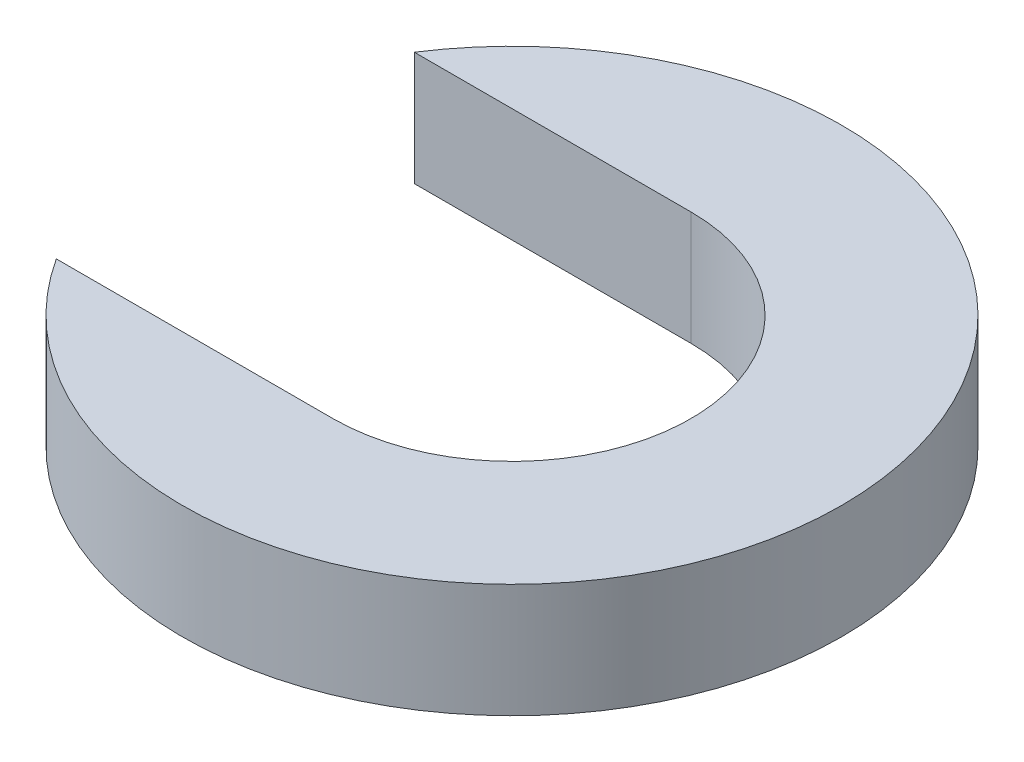
ISO-10303-21;
HEADER;
FILE_DESCRIPTION(('STEP AP214'),'2;1');
FILE_NAME('part.step','',(''),(''),'','','');
FILE_SCHEMA(('AUTOMOTIVE_DESIGN { 1 0 10303 214 1 1 1 1 }'));
ENDSEC;
DATA;
#1=APPLICATION_CONTEXT('core data for automotive mechanical design processes');
#2=APPLICATION_PROTOCOL_DEFINITION('international standard','automotive_design',2000,#1);
#3=PRODUCT_CONTEXT('',#1,'mechanical');
#4=PRODUCT('Part','Part','',(#3));
#5=PRODUCT_RELATED_PRODUCT_CATEGORY('part','',(#4));
#6=PRODUCT_DEFINITION_FORMATION('','',#4);
#7=PRODUCT_DEFINITION_CONTEXT('part definition',#1,'design');
#8=PRODUCT_DEFINITION('design','',#6,#7);
#9=PRODUCT_DEFINITION_SHAPE('','',#8);
#10=(LENGTH_UNIT() NAMED_UNIT(*) SI_UNIT(.MILLI.,.METRE.));
#11=(NAMED_UNIT(*) PLANE_ANGLE_UNIT() SI_UNIT($,.RADIAN.));
#12=(NAMED_UNIT(*) SI_UNIT($,.STERADIAN.) SOLID_ANGLE_UNIT());
#13=UNCERTAINTY_MEASURE_WITH_UNIT(LENGTH_MEASURE(1.E-05),#10,'distance_accuracy_value','');
#14=(GEOMETRIC_REPRESENTATION_CONTEXT(3) GLOBAL_UNCERTAINTY_ASSIGNED_CONTEXT((#13)) GLOBAL_UNIT_ASSIGNED_CONTEXT((#10,
#11,#12)) REPRESENTATION_CONTEXT('',''));
#15=CARTESIAN_POINT('',(0.,0.,0.));
#16=DIRECTION('',(0.,0.,1.));
#17=DIRECTION('',(1.,0.,0.));
#18=AXIS2_PLACEMENT_3D('',#15,#16,#17);
#19=CARTESIAN_POINT('',(0.,3.1496,0.));
#20=DIRECTION('',(0.,-1.,0.));
#21=DIRECTION('',(0.,0.,-1.));
#22=AXIS2_PLACEMENT_3D('',#19,#20,#21);
#23=CYLINDRICAL_SURFACE('',#22,4.953);
#24=CARTESIAN_POINT('',(0.,0.,0.));
#25=DIRECTION('',(0.,-1.,0.));
#26=DIRECTION('',(0.,0.,1.));
#27=AXIS2_PLACEMENT_3D('',#24,#25,#26);
#28=CIRCLE('',#27,4.953);
#29=CARTESIAN_POINT('',(0.,0.,-4.953));
#30=VERTEX_POINT('',#29);
#31=CARTESIAN_POINT('',(0.,0.,4.953));
#32=VERTEX_POINT('',#31);
#33=EDGE_CURVE('E102',#30,#32,#28,.T.);
#34=ORIENTED_EDGE('',*,*,#33,.T.);
#35=DIRECTION('',(0.,-1.,0.));
#36=VECTOR('',#35,1.);
#37=CARTESIAN_POINT('',(0.,3.1496,4.953));
#38=LINE('',#37,#36);
#39=CARTESIAN_POINT('',(0.,3.1496,4.953));
#40=VERTEX_POINT('',#39);
#41=EDGE_CURVE('E11',#40,#32,#38,.T.);
#42=ORIENTED_EDGE('',*,*,#41,.F.);
#43=CARTESIAN_POINT('',(0.,3.1496,0.));
#44=DIRECTION('',(0.,-1.,0.));
#45=DIRECTION('',(0.,0.,1.));
#46=AXIS2_PLACEMENT_3D('',#43,#44,#45);
#47=CIRCLE('',#46,4.953);
#48=CARTESIAN_POINT('',(0.,3.1496,-4.953));
#49=VERTEX_POINT('',#48);
#50=EDGE_CURVE('E90',#49,#40,#47,.T.);
#51=ORIENTED_EDGE('',*,*,#50,.F.);
#52=DIRECTION('',(0.,-1.,0.));
#53=VECTOR('',#52,1.);
#54=CARTESIAN_POINT('',(0.,3.1496,-4.953));
#55=LINE('',#54,#53);
#56=EDGE_CURVE('E98',#49,#30,#55,.T.);
#57=ORIENTED_EDGE('',*,*,#56,.T.);
#58=EDGE_LOOP('',(#34,#42,#51,#57));
#59=FACE_BOUND('',#58,.T.);
#60=ADVANCED_FACE('F39',(#59),#23,.F.);
#61=CARTESIAN_POINT('',(-7.65615157634696,3.1496,4.953));
#62=DIRECTION('',(0.,0.,1.));
#63=DIRECTION('',(1.,0.,0.));
#64=AXIS2_PLACEMENT_3D('',#61,#62,#63);
#65=PLANE('',#64);
#66=DIRECTION('',(-1.,0.,0.));
#67=VECTOR('',#66,1.);
#68=CARTESIAN_POINT('',(-7.65615157634696,0.,4.953));
#69=LINE('',#68,#67);
#70=CARTESIAN_POINT('',(-7.65615157634696,0.,4.953));
#71=VERTEX_POINT('',#70);
#72=EDGE_CURVE('E94',#32,#71,#69,.T.);
#73=ORIENTED_EDGE('',*,*,#72,.T.);
#74=DIRECTION('',(0.,-1.,0.));
#75=VECTOR('',#74,1.);
#76=CARTESIAN_POINT('',(-7.65615157634696,3.1496,4.953));
#77=LINE('',#76,#75);
#78=CARTESIAN_POINT('',(-7.65615157634696,3.1496,4.953));
#79=VERTEX_POINT('',#78);
#80=EDGE_CURVE('E47',#79,#71,#77,.T.);
#81=ORIENTED_EDGE('',*,*,#80,.F.);
#82=DIRECTION('',(-1.,0.,0.));
#83=VECTOR('',#82,1.);
#84=CARTESIAN_POINT('',(-7.65615157634696,3.1496,4.953));
#85=LINE('',#84,#83);
#86=EDGE_CURVE('E85',#40,#79,#85,.T.);
#87=ORIENTED_EDGE('',*,*,#86,.F.);
#88=ORIENTED_EDGE('',*,*,#41,.T.);
#89=EDGE_LOOP('',(#73,#81,#87,#88));
#90=FACE_BOUND('',#89,.T.);
#91=ADVANCED_FACE('F93',(#90),#65,.F.);
#92=CARTESIAN_POINT('',(0.,3.1496,0.));
#93=DIRECTION('',(0.,-1.,0.));
#94=DIRECTION('',(0.,0.,-1.));
#95=AXIS2_PLACEMENT_3D('',#92,#93,#94);
#96=CYLINDRICAL_SURFACE('',#95,9.1186);
#97=CARTESIAN_POINT('',(0.,0.,0.));
#98=DIRECTION('',(0.,1.,0.));
#99=DIRECTION('',(0.,0.,1.));
#100=AXIS2_PLACEMENT_3D('',#97,#98,#99);
#101=CIRCLE('',#100,9.1186);
#102=CARTESIAN_POINT('',(-7.65615157634696,0.,-4.953));
#103=VERTEX_POINT('',#102);
#104=EDGE_CURVE('E72',#71,#103,#101,.T.);
#105=ORIENTED_EDGE('',*,*,#104,.T.);
#106=DIRECTION('',(0.,-1.,0.));
#107=VECTOR('',#106,1.);
#108=CARTESIAN_POINT('',(-7.65615157634696,3.1496,-4.953));
#109=LINE('',#108,#107);
#110=CARTESIAN_POINT('',(-7.65615157634696,3.1496,-4.953));
#111=VERTEX_POINT('',#110);
#112=EDGE_CURVE('E95',#111,#103,#109,.T.);
#113=ORIENTED_EDGE('',*,*,#112,.F.);
#114=CARTESIAN_POINT('',(0.,3.1496,0.));
#115=DIRECTION('',(0.,1.,0.));
#116=DIRECTION('',(0.,0.,1.));
#117=AXIS2_PLACEMENT_3D('',#114,#115,#116);
#118=CIRCLE('',#117,9.1186);
#119=EDGE_CURVE('E88',#79,#111,#118,.T.);
#120=ORIENTED_EDGE('',*,*,#119,.F.);
#121=ORIENTED_EDGE('',*,*,#80,.T.);
#122=EDGE_LOOP('',(#105,#113,#120,#121));
#123=FACE_BOUND('',#122,.T.);
#124=ADVANCED_FACE('F96',(#123),#96,.T.);
#125=CARTESIAN_POINT('',(0.,3.1496,-4.953));
#126=DIRECTION('',(0.,0.,-1.));
#127=DIRECTION('',(-1.,0.,0.));
#128=AXIS2_PLACEMENT_3D('',#125,#126,#127);
#129=PLANE('',#128);
#130=DIRECTION('',(1.,0.,0.));
#131=VECTOR('',#130,1.);
#132=CARTESIAN_POINT('',(0.,0.,-4.953));
#133=LINE('',#132,#131);
#134=EDGE_CURVE('E78',#103,#30,#133,.T.);
#135=ORIENTED_EDGE('',*,*,#134,.T.);
#136=ORIENTED_EDGE('',*,*,#56,.F.);
#137=DIRECTION('',(1.,0.,0.));
#138=VECTOR('',#137,1.);
#139=CARTESIAN_POINT('',(0.,3.1496,-4.953));
#140=LINE('',#139,#138);
#141=EDGE_CURVE('E55',#111,#49,#140,.T.);
#142=ORIENTED_EDGE('',*,*,#141,.F.);
#143=ORIENTED_EDGE('',*,*,#112,.T.);
#144=EDGE_LOOP('',(#135,#136,#142,#143));
#145=FACE_BOUND('',#144,.T.);
#146=ADVANCED_FACE('F109',(#145),#129,.F.);
#147=CARTESIAN_POINT('',(0.,3.1496,0.));
#148=DIRECTION('',(0.,1.,0.));
#149=DIRECTION('',(0.,0.,1.));
#150=AXIS2_PLACEMENT_3D('',#147,#148,#149);
#151=PLANE('',#150);
#152=ORIENTED_EDGE('',*,*,#50,.T.);
#153=ORIENTED_EDGE('',*,*,#86,.T.);
#154=ORIENTED_EDGE('',*,*,#119,.T.);
#155=ORIENTED_EDGE('',*,*,#141,.T.);
#156=EDGE_LOOP('',(#152,#153,#154,#155));
#157=FACE_BOUND('',#156,.T.);
#158=ADVANCED_FACE('F86',(#157),#151,.T.);
#159=CARTESIAN_POINT('',(0.,0.,0.));
#160=DIRECTION('',(0.,1.,0.));
#161=DIRECTION('',(0.,0.,1.));
#162=AXIS2_PLACEMENT_3D('',#159,#160,#161);
#163=PLANE('',#162);
#164=ORIENTED_EDGE('',*,*,#33,.F.);
#165=ORIENTED_EDGE('',*,*,#134,.F.);
#166=ORIENTED_EDGE('',*,*,#104,.F.);
#167=ORIENTED_EDGE('',*,*,#72,.F.);
#168=EDGE_LOOP('',(#164,#165,#166,#167));
#169=FACE_BOUND('',#168,.T.);
#170=ADVANCED_FACE('F112',(#169),#163,.F.);
#171=CLOSED_SHELL('',(#60,#91,#124,#146,#158,#170));
#172=MANIFOLD_SOLID_BREP('B2',#171);
#173=ADVANCED_BREP_SHAPE_REPRESENTATION('',(#18,#172),#14);
#174=SHAPE_DEFINITION_REPRESENTATION(#9,#173);
ENDSEC;
END-ISO-10303-21;
